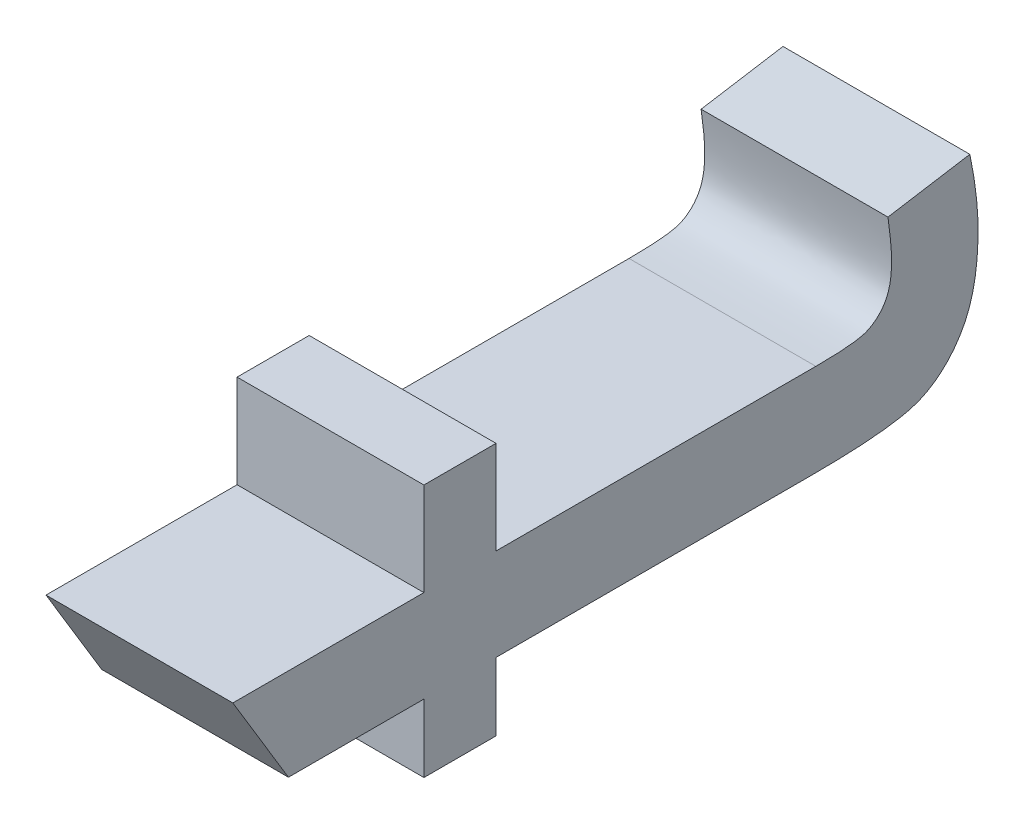
ISO-10303-21;
HEADER;
FILE_DESCRIPTION(('STEP AP214'),'2;1');
FILE_NAME('part.step','',(''),(''),'','','');
FILE_SCHEMA(('AUTOMOTIVE_DESIGN { 1 0 10303 214 1 1 1 1 }'));
ENDSEC;
DATA;
#1=APPLICATION_CONTEXT('core data for automotive mechanical design processes');
#2=APPLICATION_PROTOCOL_DEFINITION('international standard','automotive_design',2000,#1);
#3=PRODUCT_CONTEXT('',#1,'mechanical');
#4=PRODUCT('Part','Part','',(#3));
#5=PRODUCT_RELATED_PRODUCT_CATEGORY('part','',(#4));
#6=PRODUCT_DEFINITION_FORMATION('','',#4);
#7=PRODUCT_DEFINITION_CONTEXT('part definition',#1,'design');
#8=PRODUCT_DEFINITION('design','',#6,#7);
#9=PRODUCT_DEFINITION_SHAPE('','',#8);
#10=(LENGTH_UNIT() NAMED_UNIT(*) SI_UNIT(.MILLI.,.METRE.));
#11=(NAMED_UNIT(*) PLANE_ANGLE_UNIT() SI_UNIT($,.RADIAN.));
#12=(NAMED_UNIT(*) SI_UNIT($,.STERADIAN.) SOLID_ANGLE_UNIT());
#13=UNCERTAINTY_MEASURE_WITH_UNIT(LENGTH_MEASURE(1.E-05),#10,'distance_accuracy_value','');
#14=(GEOMETRIC_REPRESENTATION_CONTEXT(3) GLOBAL_UNCERTAINTY_ASSIGNED_CONTEXT((#13)) GLOBAL_UNIT_ASSIGNED_CONTEXT((#10,
#11,#12)) REPRESENTATION_CONTEXT('',''));
#15=CARTESIAN_POINT('',(0.,0.,0.));
#16=DIRECTION('',(0.,0.,1.));
#17=DIRECTION('',(1.,0.,0.));
#18=AXIS2_PLACEMENT_3D('',#15,#16,#17);
#19=CARTESIAN_POINT('',(4.55229940712926,-40.2591597344816,-8.76729471927809));
#20=DIRECTION('',(-1.,0.,0.));
#21=DIRECTION('',(0.,0.,1.));
#22=AXIS2_PLACEMENT_3D('',#19,#20,#21);
#23=PLANE('',#22);
#24=CARTESIAN_POINT('',(4.55229940712925,-40.2049248971093,-8.84692414060429));
#25=CARTESIAN_POINT('',(4.55229940712925,-40.180253903743,-8.83203884851736));
#26=CARTESIAN_POINT('',(4.55229940712925,-40.1555829103767,-8.81715355643041));
#27=(BOUNDED_CURVE() B_SPLINE_CURVE(2,(#24,#25,#26),.UNSPECIFIED.,.F.,
.F.) B_SPLINE_CURVE_WITH_KNOTS((3,3),(30.,31.),
.UNSPECIFIED.) CURVE() GEOMETRIC_REPRESENTATION_ITEM() RATIONAL_B_SPLINE_CURVE((1.,1.,1.)) REPRESENTATION_ITEM(''));
#28=CARTESIAN_POINT('',(4.55229940712925,-40.2049248971093,-8.84692414060429));
#29=VERTEX_POINT('',#28);
#30=CARTESIAN_POINT('',(4.55229940712925,-40.1555829103767,-8.81715355643041));
#31=VERTEX_POINT('',#30);
#32=EDGE_CURVE('E198',#29,#31,#27,.T.);
#33=ORIENTED_EDGE('',*,*,#32,.T.);
#34=CARTESIAN_POINT('',(4.55229940712925,-40.1555829103767,-8.81715355643041));
#35=CARTESIAN_POINT('',(4.55229940712925,-40.1555829103767,-8.86828729128463));
#36=CARTESIAN_POINT('',(4.55229940712925,-40.1555829103767,-8.91942102613884));
#37=(BOUNDED_CURVE() B_SPLINE_CURVE(2,(#34,#35,#36),.UNSPECIFIED.,.F.,
.F.) B_SPLINE_CURVE_WITH_KNOTS((3,3),(31.,32.),
.UNSPECIFIED.) CURVE() GEOMETRIC_REPRESENTATION_ITEM() RATIONAL_B_SPLINE_CURVE((1.,1.,1.)) REPRESENTATION_ITEM(''));
#38=CARTESIAN_POINT('',(4.55229940712925,-40.1555829103767,-8.91942102613884));
#39=VERTEX_POINT('',#38);
#40=EDGE_CURVE('E328',#31,#39,#37,.T.);
#41=ORIENTED_EDGE('',*,*,#40,.T.);
#42=CARTESIAN_POINT('',(4.55229940712925,-40.1555829103767,-8.91942102613884));
#43=CARTESIAN_POINT('',(4.55229940712924,-40.1306362634532,-8.91942102613884));
#44=CARTESIAN_POINT('',(4.55229940712924,-40.1056896165297,-8.91942102613884));
#45=(BOUNDED_CURVE() B_SPLINE_CURVE(2,(#42,#43,#44),.UNSPECIFIED.,.F.,
.F.) B_SPLINE_CURVE_WITH_KNOTS((3,3),(32.,33.),
.UNSPECIFIED.) CURVE() GEOMETRIC_REPRESENTATION_ITEM() RATIONAL_B_SPLINE_CURVE((1.,1.,1.)) REPRESENTATION_ITEM(''));
#46=CARTESIAN_POINT('',(4.55229940712924,-40.1056896165297,-8.91942102613884));
#47=VERTEX_POINT('',#46);
#48=EDGE_CURVE('E269',#39,#47,#45,.T.);
#49=ORIENTED_EDGE('',*,*,#48,.T.);
#50=CARTESIAN_POINT('',(4.55229940712924,-40.1056896165297,-8.91942102613884));
#51=CARTESIAN_POINT('',(4.55229940712924,-40.1056896165297,-8.93871677514042));
#52=CARTESIAN_POINT('',(4.55229940712924,-40.1056896165297,-8.95801252414201));
#53=(BOUNDED_CURVE() B_SPLINE_CURVE(2,(#50,#51,#52),.UNSPECIFIED.,.F.,
.F.) B_SPLINE_CURVE_WITH_KNOTS((3,3),(33.,34.),
.UNSPECIFIED.) CURVE() GEOMETRIC_REPRESENTATION_ITEM() RATIONAL_B_SPLINE_CURVE((1.,1.,1.)) REPRESENTATION_ITEM(''));
#54=CARTESIAN_POINT('',(4.55229940712924,-40.1056896165297,-8.95801252414201));
#55=VERTEX_POINT('',#54);
#56=EDGE_CURVE('E367',#47,#55,#53,.T.);
#57=ORIENTED_EDGE('',*,*,#56,.T.);
#58=CARTESIAN_POINT('',(4.55229940712924,-40.1056896165297,-8.95801252414201));
#59=CARTESIAN_POINT('',(4.55229940712924,-40.1306362634532,-8.95801252414201));
#60=CARTESIAN_POINT('',(4.55229940712925,-40.1555829103767,-8.95801252414201));
#61=(BOUNDED_CURVE() B_SPLINE_CURVE(2,(#58,#59,#60),.UNSPECIFIED.,.F.,
.F.) B_SPLINE_CURVE_WITH_KNOTS((3,3),(34.,35.),
.UNSPECIFIED.) CURVE() GEOMETRIC_REPRESENTATION_ITEM() RATIONAL_B_SPLINE_CURVE((1.,1.,1.)) REPRESENTATION_ITEM(''));
#62=CARTESIAN_POINT('',(4.55229940712925,-40.1555829103767,-8.95801252414201));
#63=VERTEX_POINT('',#62);
#64=EDGE_CURVE('E279',#55,#63,#61,.T.);
#65=ORIENTED_EDGE('',*,*,#64,.T.);
#66=CARTESIAN_POINT('',(4.55229940712925,-40.1555829103767,-8.95801252414201));
#67=CARTESIAN_POINT('',(4.55229940712925,-40.1555829103767,-9.04360295364191));
#68=CARTESIAN_POINT('',(4.55229940712925,-40.1555829103767,-9.12919338314181));
#69=(BOUNDED_CURVE() B_SPLINE_CURVE(2,(#66,#67,#68),.UNSPECIFIED.,.F.,
.F.) B_SPLINE_CURVE_WITH_KNOTS((3,3),(35.,36.),
.UNSPECIFIED.) CURVE() GEOMETRIC_REPRESENTATION_ITEM() RATIONAL_B_SPLINE_CURVE((1.,1.,1.)) REPRESENTATION_ITEM(''));
#70=CARTESIAN_POINT('',(4.55229940712925,-40.1555829103767,-9.12919338314181));
#71=VERTEX_POINT('',#70);
#72=EDGE_CURVE('E357',#63,#71,#69,.T.);
#73=ORIENTED_EDGE('',*,*,#72,.T.);
#74=CARTESIAN_POINT('',(4.55229940712925,-40.1555829103767,-9.12919338314181));
#75=CARTESIAN_POINT('',(4.55229940712925,-40.1555829103767,-9.15041870704356));
#76=CARTESIAN_POINT('',(4.55229940712925,-40.1529642015836,-9.1564830853012));
#77=CARTESIAN_POINT('',(4.55229940712925,-40.1503454927906,-9.16254746355884));
#78=CARTESIAN_POINT('',(4.55229940712925,-40.1444189413115,-9.166130959802));
#79=CARTESIAN_POINT('',(4.55229940712925,-40.1384923898324,-9.16971445604514));
#80=CARTESIAN_POINT('',(4.55229940712925,-40.1274662475458,-9.16971445604514));
#81=CARTESIAN_POINT('',(4.55229940712925,-40.1191966408308,-9.16971445604514));
#82=CARTESIAN_POINT('',(4.55229940712924,-40.1056896165297,-9.16778488114498));
#83=(BOUNDED_CURVE() B_SPLINE_CURVE(2,(#74,#75,#76,#77,#78,#79,#80,#81,#82),.UNSPECIFIED.,.F.,
.F.) B_SPLINE_CURVE_WITH_KNOTS((3,2,2,2,3),(36.,37.,38.,39.,40.),
.UNSPECIFIED.) CURVE() GEOMETRIC_REPRESENTATION_ITEM() RATIONAL_B_SPLINE_CURVE((1.,1.,1.,1.,1.,
1.,1.,1.,1.)) REPRESENTATION_ITEM(''));
#84=CARTESIAN_POINT('',(4.55229940712924,-40.1056896165297,-9.16778488114498));
#85=VERTEX_POINT('',#84);
#86=EDGE_CURVE('E187',#71,#85,#83,.T.);
#87=ORIENTED_EDGE('',*,*,#86,.T.);
#88=CARTESIAN_POINT('',(4.55229940712924,-40.1056896165297,-9.16778488114498));
#89=CARTESIAN_POINT('',(4.55229940712924,-40.1021061202866,-9.18969933893964));
#90=CARTESIAN_POINT('',(4.55229940712924,-40.0985226240434,-9.21161379673431));
#91=(BOUNDED_CURVE() B_SPLINE_CURVE(2,(#88,#89,#90),.UNSPECIFIED.,.F.,
.F.) B_SPLINE_CURVE_WITH_KNOTS((3,3),(40.,41.),
.UNSPECIFIED.) CURVE() GEOMETRIC_REPRESENTATION_ITEM() RATIONAL_B_SPLINE_CURVE((1.,1.,1.)) REPRESENTATION_ITEM(''));
#92=CARTESIAN_POINT('',(4.55229940712924,-40.0985226240434,-9.21161379673431));
#93=VERTEX_POINT('',#92);
#94=EDGE_CURVE('E257',#85,#93,#91,.T.);
#95=ORIENTED_EDGE('',*,*,#94,.T.);
#96=CARTESIAN_POINT('',(4.55229940712924,-40.0985226240434,-9.21161379673431));
#97=CARTESIAN_POINT('',(4.55229940712925,-40.119472294388,-9.21602425364896));
#98=CARTESIAN_POINT('',(4.55229940712925,-40.1360115078179,-9.21602425364896));
#99=CARTESIAN_POINT('',(4.55229940712925,-40.1630255564201,-9.21602425364896));
#100=CARTESIAN_POINT('',(4.55229940712925,-40.1779108485071,-9.20747899337683));
#101=CARTESIAN_POINT('',(4.55229940712926,-40.192796140594,-9.19893373310469));
#102=CARTESIAN_POINT('',(4.55229940712926,-40.1988605188517,-9.18501322846783));
#103=CARTESIAN_POINT('',(4.55229940712926,-40.2049248971093,-9.17109272383097));
#104=CARTESIAN_POINT('',(4.55229940712926,-40.2049248971093,-9.12643684757015));
#105=(BOUNDED_CURVE() B_SPLINE_CURVE(2,(#96,#97,#98,#99,#100,#101,#102,#103,#104),.UNSPECIFIED.,
.F.,.F.) B_SPLINE_CURVE_WITH_KNOTS((3,2,2,2,3),(41.,42.,43.,44.,45.),
.UNSPECIFIED.) CURVE() GEOMETRIC_REPRESENTATION_ITEM() RATIONAL_B_SPLINE_CURVE((1.,1.,1.,1.,1.,
1.,1.,1.,1.)) REPRESENTATION_ITEM(''));
#106=CARTESIAN_POINT('',(4.55229940712926,-40.2049248971093,-9.12643684757015));
#107=VERTEX_POINT('',#106);
#108=EDGE_CURVE('E168',#93,#107,#105,.T.);
#109=ORIENTED_EDGE('',*,*,#108,.T.);
#110=CARTESIAN_POINT('',(4.55229940712926,-40.2049248971093,-9.12643684757015));
#111=CARTESIAN_POINT('',(4.55229940712926,-40.2049248971093,-9.04222468585608));
#112=CARTESIAN_POINT('',(4.55229940712926,-40.2049248971093,-8.95801252414201));
#113=(BOUNDED_CURVE() B_SPLINE_CURVE(2,(#110,#111,#112),.UNSPECIFIED.,.F.,
.F.) B_SPLINE_CURVE_WITH_KNOTS((3,3),(45.,46.),
.UNSPECIFIED.) CURVE() GEOMETRIC_REPRESENTATION_ITEM() RATIONAL_B_SPLINE_CURVE((1.,1.,1.)) REPRESENTATION_ITEM(''));
#114=CARTESIAN_POINT('',(4.55229940712926,-40.2049248971093,-8.95801252414201));
#115=VERTEX_POINT('',#114);
#116=EDGE_CURVE('E165',#107,#115,#113,.T.);
#117=ORIENTED_EDGE('',*,*,#116,.T.);
#118=CARTESIAN_POINT('',(4.55229940712926,-40.2049248971093,-8.95801252414201));
#119=CARTESIAN_POINT('',(4.55229940712926,-40.2231180318822,-8.95801252414201));
#120=CARTESIAN_POINT('',(4.55229940712926,-40.2413111666552,-8.95801252414201));
#121=(BOUNDED_CURVE() B_SPLINE_CURVE(2,(#118,#119,#120),.UNSPECIFIED.,.F.,
.F.) B_SPLINE_CURVE_WITH_KNOTS((3,3),(46.,47.),
.UNSPECIFIED.) CURVE() GEOMETRIC_REPRESENTATION_ITEM() RATIONAL_B_SPLINE_CURVE((1.,1.,1.)) REPRESENTATION_ITEM(''));
#122=CARTESIAN_POINT('',(4.55229940712926,-40.2413111666552,-8.95801252414201));
#123=VERTEX_POINT('',#122);
#124=EDGE_CURVE('E152',#115,#123,#121,.T.);
#125=ORIENTED_EDGE('',*,*,#124,.T.);
#126=CARTESIAN_POINT('',(4.55229940712926,-40.2413111666552,-8.95801252414201));
#127=CARTESIAN_POINT('',(4.55229940712926,-40.2413111666552,-8.93871677514042));
#128=CARTESIAN_POINT('',(4.55229940712926,-40.2413111666552,-8.91942102613884));
#129=(BOUNDED_CURVE() B_SPLINE_CURVE(2,(#126,#127,#128),.UNSPECIFIED.,.F.,
.F.) B_SPLINE_CURVE_WITH_KNOTS((3,3),(47.,48.),
.UNSPECIFIED.) CURVE() GEOMETRIC_REPRESENTATION_ITEM() RATIONAL_B_SPLINE_CURVE((1.,1.,1.)) REPRESENTATION_ITEM(''));
#130=CARTESIAN_POINT('',(4.55229940712926,-40.2413111666552,-8.91942102613884));
#131=VERTEX_POINT('',#130);
#132=EDGE_CURVE('E423',#123,#131,#129,.T.);
#133=ORIENTED_EDGE('',*,*,#132,.T.);
#134=CARTESIAN_POINT('',(4.55229940712926,-40.2413111666552,-8.91942102613884));
#135=CARTESIAN_POINT('',(4.55229940712926,-40.2231180318822,-8.91942102613884));
#136=CARTESIAN_POINT('',(4.55229940712926,-40.2049248971093,-8.91942102613884));
#137=(BOUNDED_CURVE() B_SPLINE_CURVE(2,(#134,#135,#136),.UNSPECIFIED.,.F.,
.F.) B_SPLINE_CURVE_WITH_KNOTS((3,3),(48.,49.),
.UNSPECIFIED.) CURVE() GEOMETRIC_REPRESENTATION_ITEM() RATIONAL_B_SPLINE_CURVE((1.,1.,1.)) REPRESENTATION_ITEM(''));
#138=CARTESIAN_POINT('',(4.55229940712926,-40.2049248971093,-8.91942102613884));
#139=VERTEX_POINT('',#138);
#140=EDGE_CURVE('E224',#131,#139,#137,.T.);
#141=ORIENTED_EDGE('',*,*,#140,.T.);
#142=CARTESIAN_POINT('',(4.55229940712926,-40.2049248971093,-8.91942102613884));
#143=CARTESIAN_POINT('',(4.55229940712925,-40.2049248971093,-8.88317258337157));
#144=CARTESIAN_POINT('',(4.55229940712925,-40.2049248971093,-8.84692414060429));
#145=(BOUNDED_CURVE() B_SPLINE_CURVE(2,(#142,#143,#144),.UNSPECIFIED.,.F.,
.F.) B_SPLINE_CURVE_WITH_KNOTS((3,3),(49.,50.),
.UNSPECIFIED.) CURVE() GEOMETRIC_REPRESENTATION_ITEM() RATIONAL_B_SPLINE_CURVE((1.,1.,1.)) REPRESENTATION_ITEM(''));
#146=EDGE_CURVE('E11',#139,#29,#145,.T.);
#147=ORIENTED_EDGE('',*,*,#146,.T.);
#148=EDGE_LOOP('',(#33,#41,#49,#57,#65,#73,#87,#95,#109,#117,#125,#133,#141,#147));
#149=FACE_BOUND('',#148,.T.);
#150=ADVANCED_FACE('F16',(#149),#23,.T.);
#151=CARTESIAN_POINT('',(4.65229940712926,-40.2591597344816,-8.76729471927809));
#152=DIRECTION('',(1.,0.,0.));
#153=DIRECTION('',(0.,1.,0.));
#154=AXIS2_PLACEMENT_3D('',#151,#152,#153);
#155=PLANE('',#154);
#156=CARTESIAN_POINT('',(4.65229940712926,-40.2049248971093,-8.91942102613884));
#157=CARTESIAN_POINT('',(4.65229940712926,-40.2049248971093,-8.88317258337157));
#158=CARTESIAN_POINT('',(4.65229940712926,-40.2049248971093,-8.84692414060429));
#159=(BOUNDED_CURVE() B_SPLINE_CURVE(2,(#156,#157,#158),.UNSPECIFIED.,.F.,
.F.) B_SPLINE_CURVE_WITH_KNOTS((3,3),(49.,50.),
.UNSPECIFIED.) CURVE() GEOMETRIC_REPRESENTATION_ITEM() RATIONAL_B_SPLINE_CURVE((1.,1.,1.)) REPRESENTATION_ITEM(''));
#160=CARTESIAN_POINT('',(4.65229940712926,-40.2049248971093,-8.91942102613884));
#161=VERTEX_POINT('',#160);
#162=CARTESIAN_POINT('',(4.65229940712926,-40.2049248971093,-8.84692414060429));
#163=VERTEX_POINT('',#162);
#164=EDGE_CURVE('E31',#161,#163,#159,.T.);
#165=ORIENTED_EDGE('',*,*,#164,.F.);
#166=CARTESIAN_POINT('',(4.65229940712926,-40.2413111666552,-8.91942102613884));
#167=CARTESIAN_POINT('',(4.65229940712926,-40.2231180318822,-8.91942102613884));
#168=CARTESIAN_POINT('',(4.65229940712926,-40.2049248971093,-8.91942102613884));
#169=(BOUNDED_CURVE() B_SPLINE_CURVE(2,(#166,#167,#168),.UNSPECIFIED.,.F.,
.F.) B_SPLINE_CURVE_WITH_KNOTS((3,3),(48.,49.),
.UNSPECIFIED.) CURVE() GEOMETRIC_REPRESENTATION_ITEM() RATIONAL_B_SPLINE_CURVE((1.,1.,1.)) REPRESENTATION_ITEM(''));
#170=CARTESIAN_POINT('',(4.65229940712926,-40.2413111666552,-8.91942102613884));
#171=VERTEX_POINT('',#170);
#172=EDGE_CURVE('E225',#171,#161,#169,.T.);
#173=ORIENTED_EDGE('',*,*,#172,.F.);
#174=CARTESIAN_POINT('',(4.65229940712926,-40.2413111666552,-8.95801252414201));
#175=CARTESIAN_POINT('',(4.65229940712926,-40.2413111666552,-8.93871677514042));
#176=CARTESIAN_POINT('',(4.65229940712926,-40.2413111666552,-8.91942102613884));
#177=(BOUNDED_CURVE() B_SPLINE_CURVE(2,(#174,#175,#176),.UNSPECIFIED.,.F.,
.F.) B_SPLINE_CURVE_WITH_KNOTS((3,3),(47.,48.),
.UNSPECIFIED.) CURVE() GEOMETRIC_REPRESENTATION_ITEM() RATIONAL_B_SPLINE_CURVE((1.,1.,1.)) REPRESENTATION_ITEM(''));
#178=CARTESIAN_POINT('',(4.65229940712926,-40.2413111666552,-8.95801252414201));
#179=VERTEX_POINT('',#178);
#180=EDGE_CURVE('E162',#179,#171,#177,.T.);
#181=ORIENTED_EDGE('',*,*,#180,.F.);
#182=CARTESIAN_POINT('',(4.65229940712926,-40.2049248971093,-8.95801252414201));
#183=CARTESIAN_POINT('',(4.65229940712926,-40.2231180318822,-8.95801252414201));
#184=CARTESIAN_POINT('',(4.65229940712926,-40.2413111666552,-8.95801252414201));
#185=(BOUNDED_CURVE() B_SPLINE_CURVE(2,(#182,#183,#184),.UNSPECIFIED.,.F.,
.F.) B_SPLINE_CURVE_WITH_KNOTS((3,3),(46.,47.),
.UNSPECIFIED.) CURVE() GEOMETRIC_REPRESENTATION_ITEM() RATIONAL_B_SPLINE_CURVE((1.,1.,1.)) REPRESENTATION_ITEM(''));
#186=CARTESIAN_POINT('',(4.65229940712926,-40.2049248971093,-8.95801252414201));
#187=VERTEX_POINT('',#186);
#188=EDGE_CURVE('E22',#187,#179,#185,.T.);
#189=ORIENTED_EDGE('',*,*,#188,.F.);
#190=CARTESIAN_POINT('',(4.65229940712926,-40.2049248971093,-9.12643684757015));
#191=CARTESIAN_POINT('',(4.65229940712926,-40.2049248971093,-9.04222468585608));
#192=CARTESIAN_POINT('',(4.65229940712926,-40.2049248971093,-8.95801252414201));
#193=(BOUNDED_CURVE() B_SPLINE_CURVE(2,(#190,#191,#192),.UNSPECIFIED.,.F.,
.F.) B_SPLINE_CURVE_WITH_KNOTS((3,3),(45.,46.),
.UNSPECIFIED.) CURVE() GEOMETRIC_REPRESENTATION_ITEM() RATIONAL_B_SPLINE_CURVE((1.,1.,1.)) REPRESENTATION_ITEM(''));
#194=CARTESIAN_POINT('',(4.65229940712926,-40.2049248971093,-9.12643684757015));
#195=VERTEX_POINT('',#194);
#196=EDGE_CURVE('E175',#195,#187,#193,.T.);
#197=ORIENTED_EDGE('',*,*,#196,.F.);
#198=CARTESIAN_POINT('',(4.65229940712925,-40.0985226240434,-9.21161379673431));
#199=CARTESIAN_POINT('',(4.65229940712925,-40.119472294388,-9.21602425364896));
#200=CARTESIAN_POINT('',(4.65229940712925,-40.1360115078179,-9.21602425364896));
#201=CARTESIAN_POINT('',(4.65229940712925,-40.1630255564201,-9.21602425364896));
#202=CARTESIAN_POINT('',(4.65229940712926,-40.1779108485071,-9.20747899337683));
#203=CARTESIAN_POINT('',(4.65229940712926,-40.192796140594,-9.19893373310469));
#204=CARTESIAN_POINT('',(4.65229940712926,-40.1988605188516,-9.18501322846783));
#205=CARTESIAN_POINT('',(4.65229940712926,-40.2049248971093,-9.17109272383097));
#206=CARTESIAN_POINT('',(4.65229940712926,-40.2049248971093,-9.12643684757015));
#207=(BOUNDED_CURVE() B_SPLINE_CURVE(2,(#198,#199,#200,#201,#202,#203,#204,#205,#206),
.UNSPECIFIED.,.F.,.F.) B_SPLINE_CURVE_WITH_KNOTS((3,2,2,2,3),(41.,42.,43.,44.,45.),
.UNSPECIFIED.) CURVE() GEOMETRIC_REPRESENTATION_ITEM() RATIONAL_B_SPLINE_CURVE((1.,1.,1.,1.,1.,
1.,1.,1.,1.)) REPRESENTATION_ITEM(''));
#208=CARTESIAN_POINT('',(4.65229940712925,-40.0985226240434,-9.21161379673431));
#209=VERTEX_POINT('',#208);
#210=EDGE_CURVE('E288',#209,#195,#207,.T.);
#211=ORIENTED_EDGE('',*,*,#210,.F.);
#212=CARTESIAN_POINT('',(4.65229940712925,-40.1056896165297,-9.16778488114498));
#213=CARTESIAN_POINT('',(4.65229940712925,-40.1021061202866,-9.18969933893964));
#214=CARTESIAN_POINT('',(4.65229940712925,-40.0985226240434,-9.21161379673431));
#215=(BOUNDED_CURVE() B_SPLINE_CURVE(2,(#212,#213,#214),.UNSPECIFIED.,.F.,
.F.) B_SPLINE_CURVE_WITH_KNOTS((3,3),(40.,41.),
.UNSPECIFIED.) CURVE() GEOMETRIC_REPRESENTATION_ITEM() RATIONAL_B_SPLINE_CURVE((1.,1.,1.)) REPRESENTATION_ITEM(''));
#216=CARTESIAN_POINT('',(4.65229940712925,-40.1056896165297,-9.16778488114498));
#217=VERTEX_POINT('',#216);
#218=EDGE_CURVE('E258',#217,#209,#215,.T.);
#219=ORIENTED_EDGE('',*,*,#218,.F.);
#220=CARTESIAN_POINT('',(4.65229940712925,-40.1555829103767,-9.12919338314181));
#221=CARTESIAN_POINT('',(4.65229940712925,-40.1555829103767,-9.15041870704356));
#222=CARTESIAN_POINT('',(4.65229940712925,-40.1529642015836,-9.1564830853012));
#223=CARTESIAN_POINT('',(4.65229940712925,-40.1503454927905,-9.16254746355885));
#224=CARTESIAN_POINT('',(4.65229940712925,-40.1444189413115,-9.166130959802));
#225=CARTESIAN_POINT('',(4.65229940712925,-40.1384923898324,-9.16971445604514));
#226=CARTESIAN_POINT('',(4.65229940712925,-40.1274662475458,-9.16971445604515));
#227=CARTESIAN_POINT('',(4.65229940712925,-40.1191966408308,-9.16971445604515));
#228=CARTESIAN_POINT('',(4.65229940712925,-40.1056896165297,-9.16778488114498));
#229=(BOUNDED_CURVE() B_SPLINE_CURVE(2,(#220,#221,#222,#223,#224,#225,#226,#227,#228),
.UNSPECIFIED.,.F.,.F.) B_SPLINE_CURVE_WITH_KNOTS((3,2,2,2,3),(36.,37.,38.,39.,40.),
.UNSPECIFIED.) CURVE() GEOMETRIC_REPRESENTATION_ITEM() RATIONAL_B_SPLINE_CURVE((1.,1.,1.,1.,1.,
1.,1.,1.,1.)) REPRESENTATION_ITEM(''));
#230=CARTESIAN_POINT('',(4.65229940712925,-40.1555829103767,-9.12919338314181));
#231=VERTEX_POINT('',#230);
#232=EDGE_CURVE('E347',#231,#217,#229,.T.);
#233=ORIENTED_EDGE('',*,*,#232,.F.);
#234=CARTESIAN_POINT('',(4.65229940712925,-40.1555829103767,-8.95801252414201));
#235=CARTESIAN_POINT('',(4.65229940712925,-40.1555829103767,-9.04360295364191));
#236=CARTESIAN_POINT('',(4.65229940712925,-40.1555829103767,-9.12919338314181));
#237=(BOUNDED_CURVE() B_SPLINE_CURVE(2,(#234,#235,#236),.UNSPECIFIED.,.F.,
.F.) B_SPLINE_CURVE_WITH_KNOTS((3,3),(35.,36.),
.UNSPECIFIED.) CURVE() GEOMETRIC_REPRESENTATION_ITEM() RATIONAL_B_SPLINE_CURVE((1.,1.,1.)) REPRESENTATION_ITEM(''));
#238=CARTESIAN_POINT('',(4.65229940712925,-40.1555829103767,-8.95801252414201));
#239=VERTEX_POINT('',#238);
#240=EDGE_CURVE('E358',#239,#231,#237,.T.);
#241=ORIENTED_EDGE('',*,*,#240,.F.);
#242=CARTESIAN_POINT('',(4.65229940712924,-40.1056896165297,-8.95801252414201));
#243=CARTESIAN_POINT('',(4.65229940712925,-40.1306362634532,-8.95801252414201));
#244=CARTESIAN_POINT('',(4.65229940712925,-40.1555829103767,-8.95801252414201));
#245=(BOUNDED_CURVE() B_SPLINE_CURVE(2,(#242,#243,#244),.UNSPECIFIED.,.F.,
.F.) B_SPLINE_CURVE_WITH_KNOTS((3,3),(34.,35.),
.UNSPECIFIED.) CURVE() GEOMETRIC_REPRESENTATION_ITEM() RATIONAL_B_SPLINE_CURVE((1.,1.,1.)) REPRESENTATION_ITEM(''));
#246=CARTESIAN_POINT('',(4.65229940712924,-40.1056896165297,-8.95801252414201));
#247=VERTEX_POINT('',#246);
#248=EDGE_CURVE('E280',#247,#239,#245,.T.);
#249=ORIENTED_EDGE('',*,*,#248,.F.);
#250=CARTESIAN_POINT('',(4.65229940712924,-40.1056896165297,-8.91942102613884));
#251=CARTESIAN_POINT('',(4.65229940712924,-40.1056896165297,-8.93871677514042));
#252=CARTESIAN_POINT('',(4.65229940712924,-40.1056896165297,-8.95801252414201));
#253=(BOUNDED_CURVE() B_SPLINE_CURVE(2,(#250,#251,#252),.UNSPECIFIED.,.F.,
.F.) B_SPLINE_CURVE_WITH_KNOTS((3,3),(33.,34.),
.UNSPECIFIED.) CURVE() GEOMETRIC_REPRESENTATION_ITEM() RATIONAL_B_SPLINE_CURVE((1.,1.,1.)) REPRESENTATION_ITEM(''));
#254=CARTESIAN_POINT('',(4.65229940712924,-40.1056896165297,-8.91942102613884));
#255=VERTEX_POINT('',#254);
#256=EDGE_CURVE('E259',#255,#247,#253,.T.);
#257=ORIENTED_EDGE('',*,*,#256,.F.);
#258=CARTESIAN_POINT('',(4.65229940712925,-40.1555829103767,-8.91942102613884));
#259=CARTESIAN_POINT('',(4.65229940712925,-40.1306362634532,-8.91942102613884));
#260=CARTESIAN_POINT('',(4.65229940712924,-40.1056896165297,-8.91942102613884));
#261=(BOUNDED_CURVE() B_SPLINE_CURVE(2,(#258,#259,#260),.UNSPECIFIED.,.F.,
.F.) B_SPLINE_CURVE_WITH_KNOTS((3,3),(32.,33.),
.UNSPECIFIED.) CURVE() GEOMETRIC_REPRESENTATION_ITEM() RATIONAL_B_SPLINE_CURVE((1.,1.,1.)) REPRESENTATION_ITEM(''));
#262=CARTESIAN_POINT('',(4.65229940712925,-40.1555829103767,-8.91942102613884));
#263=VERTEX_POINT('',#262);
#264=EDGE_CURVE('E319',#263,#255,#261,.T.);
#265=ORIENTED_EDGE('',*,*,#264,.F.);
#266=CARTESIAN_POINT('',(4.65229940712925,-40.1555829103767,-8.81715355643042));
#267=CARTESIAN_POINT('',(4.65229940712925,-40.1555829103767,-8.86828729128463));
#268=CARTESIAN_POINT('',(4.65229940712925,-40.1555829103767,-8.91942102613884));
#269=(BOUNDED_CURVE() B_SPLINE_CURVE(2,(#266,#267,#268),.UNSPECIFIED.,.F.,
.F.) B_SPLINE_CURVE_WITH_KNOTS((3,3),(31.,32.),
.UNSPECIFIED.) CURVE() GEOMETRIC_REPRESENTATION_ITEM() RATIONAL_B_SPLINE_CURVE((1.,1.,1.)) REPRESENTATION_ITEM(''));
#270=CARTESIAN_POINT('',(4.65229940712925,-40.1555829103767,-8.81715355643042));
#271=VERTEX_POINT('',#270);
#272=EDGE_CURVE('E197',#271,#263,#269,.T.);
#273=ORIENTED_EDGE('',*,*,#272,.F.);
#274=CARTESIAN_POINT('',(4.65229940712926,-40.2049248971093,-8.84692414060429));
#275=CARTESIAN_POINT('',(4.65229940712925,-40.180253903743,-8.83203884851736));
#276=CARTESIAN_POINT('',(4.65229940712925,-40.1555829103767,-8.81715355643042));
#277=(BOUNDED_CURVE() B_SPLINE_CURVE(2,(#274,#275,#276),.UNSPECIFIED.,.F.,
.F.) B_SPLINE_CURVE_WITH_KNOTS((3,3),(30.,31.),
.UNSPECIFIED.) CURVE() GEOMETRIC_REPRESENTATION_ITEM() RATIONAL_B_SPLINE_CURVE((1.,1.,1.)) REPRESENTATION_ITEM(''));
#278=EDGE_CURVE('E239',#163,#271,#277,.T.);
#279=ORIENTED_EDGE('',*,*,#278,.F.);
#280=EDGE_LOOP('',(#165,#173,#181,#189,#197,#211,#219,#233,#241,#249,#257,#265,#273,#279));
#281=FACE_BOUND('',#280,.T.);
#282=ADVANCED_FACE('F528',(#281),#155,.T.);
#283=CARTESIAN_POINT('',(4.65229940712926,-40.2049248971093,-8.91942102613884));
#284=CARTESIAN_POINT('',(4.55229940712926,-40.2049248971093,-8.91942102613884));
#285=CARTESIAN_POINT('',(4.65229940712926,-40.2049248971093,-8.88317258337157));
#286=CARTESIAN_POINT('',(4.55229940712925,-40.2049248971093,-8.88317258337157));
#287=CARTESIAN_POINT('',(4.65229940712926,-40.2049248971093,-8.84692414060429));
#288=CARTESIAN_POINT('',(4.55229940712925,-40.2049248971093,-8.84692414060429));
#289=(BOUNDED_SURFACE() B_SPLINE_SURFACE(2,1,((#283,#284),(#285,#286),(#287,#288)),
.UNSPECIFIED.,.F.,.F.,.F.) B_SPLINE_SURFACE_WITH_KNOTS((3,3),(2,2),(49.,50.),(0.,0.1),
.UNSPECIFIED.) GEOMETRIC_REPRESENTATION_ITEM() RATIONAL_B_SPLINE_SURFACE(((1.,1.),(1.,1.),(1.,1.))) REPRESENTATION_ITEM('') SURFACE());
#290=CARTESIAN_POINT('',(4.65229940712926,-40.2049248971093,-8.84692414060429));
#291=CARTESIAN_POINT('',(4.55229940712925,-40.2049248971093,-8.84692414060429));
#292=(BOUNDED_CURVE() B_SPLINE_CURVE(1,(#290,#291),.UNSPECIFIED.,.F.,
.F.) B_SPLINE_CURVE_WITH_KNOTS((2,2),(0.,0.1),
.UNSPECIFIED.) CURVE() GEOMETRIC_REPRESENTATION_ITEM() RATIONAL_B_SPLINE_CURVE((1.,1.)) REPRESENTATION_ITEM(''));
#293=EDGE_CURVE('E190',#163,#29,#292,.T.);
#294=CARTESIAN_POINT('',(4.65229940712926,-40.2049248971093,-8.91942102613884));
#295=CARTESIAN_POINT('',(4.55229940712926,-40.2049248971093,-8.91942102613884));
#296=(BOUNDED_CURVE() B_SPLINE_CURVE(1,(#294,#295),.UNSPECIFIED.,.F.,
.F.) B_SPLINE_CURVE_WITH_KNOTS((2,2),(0.,0.1),
.UNSPECIFIED.) CURVE() GEOMETRIC_REPRESENTATION_ITEM() RATIONAL_B_SPLINE_CURVE((1.,1.)) REPRESENTATION_ITEM(''));
#297=EDGE_CURVE('E216',#161,#139,#296,.T.);
#298=ORIENTED_EDGE('',*,*,#164,.T.);
#299=ORIENTED_EDGE('',*,*,#293,.T.);
#300=ORIENTED_EDGE('',*,*,#146,.F.);
#301=ORIENTED_EDGE('',*,*,#297,.F.);
#302=EDGE_LOOP('',(#298,#299,#300,#301));
#303=FACE_BOUND('',#302,.T.);
#304=ADVANCED_FACE('F558',(#303),#289,.T.);
#305=CARTESIAN_POINT('',(4.65229940712926,-40.2413111666552,-8.91942102613884));
#306=CARTESIAN_POINT('',(4.55229940712926,-40.2413111666552,-8.91942102613884));
#307=CARTESIAN_POINT('',(4.65229940712926,-40.2231180318822,-8.91942102613884));
#308=CARTESIAN_POINT('',(4.55229940712926,-40.2231180318822,-8.91942102613884));
#309=CARTESIAN_POINT('',(4.65229940712926,-40.2049248971093,-8.91942102613884));
#310=CARTESIAN_POINT('',(4.55229940712926,-40.2049248971093,-8.91942102613884));
#311=(BOUNDED_SURFACE() B_SPLINE_SURFACE(2,1,((#305,#306),(#307,#308),(#309,#310)),
.UNSPECIFIED.,.F.,.F.,.F.) B_SPLINE_SURFACE_WITH_KNOTS((3,3),(2,2),(48.,49.),(0.,0.1),
.UNSPECIFIED.) GEOMETRIC_REPRESENTATION_ITEM() RATIONAL_B_SPLINE_SURFACE(((1.,1.),(1.,1.),(1.,1.))) REPRESENTATION_ITEM('') SURFACE());
#312=CARTESIAN_POINT('',(4.65229940712926,-40.2413111666552,-8.91942102613884));
#313=CARTESIAN_POINT('',(4.55229940712926,-40.2413111666552,-8.91942102613884));
#314=(BOUNDED_CURVE() B_SPLINE_CURVE(1,(#312,#313),.UNSPECIFIED.,.F.,
.F.) B_SPLINE_CURVE_WITH_KNOTS((2,2),(0.,0.1),
.UNSPECIFIED.) CURVE() GEOMETRIC_REPRESENTATION_ITEM() RATIONAL_B_SPLINE_CURVE((1.,1.)) REPRESENTATION_ITEM(''));
#315=EDGE_CURVE('E207',#171,#131,#314,.T.);
#316=ORIENTED_EDGE('',*,*,#172,.T.);
#317=ORIENTED_EDGE('',*,*,#297,.T.);
#318=ORIENTED_EDGE('',*,*,#140,.F.);
#319=ORIENTED_EDGE('',*,*,#315,.F.);
#320=EDGE_LOOP('',(#316,#317,#318,#319));
#321=FACE_BOUND('',#320,.T.);
#322=ADVANCED_FACE('F598',(#321),#311,.T.);
#323=CARTESIAN_POINT('',(4.65229940712926,-40.2413111666552,-8.95801252414201));
#324=CARTESIAN_POINT('',(4.55229940712926,-40.2413111666552,-8.95801252414201));
#325=CARTESIAN_POINT('',(4.65229940712926,-40.2413111666552,-8.93871677514042));
#326=CARTESIAN_POINT('',(4.55229940712926,-40.2413111666552,-8.93871677514042));
#327=CARTESIAN_POINT('',(4.65229940712926,-40.2413111666552,-8.91942102613884));
#328=CARTESIAN_POINT('',(4.55229940712926,-40.2413111666552,-8.91942102613884));
#329=(BOUNDED_SURFACE() B_SPLINE_SURFACE(2,1,((#323,#324),(#325,#326),(#327,#328)),
.UNSPECIFIED.,.F.,.F.,.F.) B_SPLINE_SURFACE_WITH_KNOTS((3,3),(2,2),(47.,48.),(0.,0.1),
.UNSPECIFIED.) GEOMETRIC_REPRESENTATION_ITEM() RATIONAL_B_SPLINE_SURFACE(((1.,1.),(1.,1.),(1.,1.))) REPRESENTATION_ITEM('') SURFACE());
#330=CARTESIAN_POINT('',(4.65229940712926,-40.2413111666552,-8.95801252414201));
#331=CARTESIAN_POINT('',(4.55229940712926,-40.2413111666552,-8.95801252414201));
#332=(BOUNDED_CURVE() B_SPLINE_CURVE(1,(#330,#331),.UNSPECIFIED.,.F.,
.F.) B_SPLINE_CURVE_WITH_KNOTS((2,2),(0.,0.1),
.UNSPECIFIED.) CURVE() GEOMETRIC_REPRESENTATION_ITEM() RATIONAL_B_SPLINE_CURVE((1.,1.)) REPRESENTATION_ITEM(''));
#333=EDGE_CURVE('E158',#179,#123,#332,.T.);
#334=ORIENTED_EDGE('',*,*,#180,.T.);
#335=ORIENTED_EDGE('',*,*,#315,.T.);
#336=ORIENTED_EDGE('',*,*,#132,.F.);
#337=ORIENTED_EDGE('',*,*,#333,.F.);
#338=EDGE_LOOP('',(#334,#335,#336,#337));
#339=FACE_BOUND('',#338,.T.);
#340=ADVANCED_FACE('F588',(#339),#329,.T.);
#341=CARTESIAN_POINT('',(4.65229940712926,-40.2049248971093,-8.95801252414201));
#342=CARTESIAN_POINT('',(4.55229940712926,-40.2049248971093,-8.95801252414201));
#343=CARTESIAN_POINT('',(4.65229940712926,-40.2231180318822,-8.95801252414201));
#344=CARTESIAN_POINT('',(4.55229940712926,-40.2231180318822,-8.95801252414201));
#345=CARTESIAN_POINT('',(4.65229940712926,-40.2413111666552,-8.95801252414201));
#346=CARTESIAN_POINT('',(4.55229940712926,-40.2413111666552,-8.95801252414201));
#347=(BOUNDED_SURFACE() B_SPLINE_SURFACE(2,1,((#341,#342),(#343,#344),(#345,#346)),
.UNSPECIFIED.,.F.,.F.,.F.) B_SPLINE_SURFACE_WITH_KNOTS((3,3),(2,2),(46.,47.),(0.,0.1),
.UNSPECIFIED.) GEOMETRIC_REPRESENTATION_ITEM() RATIONAL_B_SPLINE_SURFACE(((1.,1.),(1.,1.),(1.,1.))) REPRESENTATION_ITEM('') SURFACE());
#348=CARTESIAN_POINT('',(4.65229940712926,-40.2049248971093,-8.95801252414201));
#349=CARTESIAN_POINT('',(4.55229940712926,-40.2049248971093,-8.95801252414201));
#350=(BOUNDED_CURVE() B_SPLINE_CURVE(1,(#348,#349),.UNSPECIFIED.,.F.,
.F.) B_SPLINE_CURVE_WITH_KNOTS((2,2),(0.,0.1),
.UNSPECIFIED.) CURVE() GEOMETRIC_REPRESENTATION_ITEM() RATIONAL_B_SPLINE_CURVE((1.,1.)) REPRESENTATION_ITEM(''));
#351=EDGE_CURVE('E155',#187,#115,#350,.T.);
#352=ORIENTED_EDGE('',*,*,#188,.T.);
#353=ORIENTED_EDGE('',*,*,#333,.T.);
#354=ORIENTED_EDGE('',*,*,#124,.F.);
#355=ORIENTED_EDGE('',*,*,#351,.F.);
#356=EDGE_LOOP('',(#352,#353,#354,#355));
#357=FACE_BOUND('',#356,.T.);
#358=ADVANCED_FACE('F18',(#357),#347,.T.);
#359=CARTESIAN_POINT('',(4.65229940712926,-40.2049248971093,-9.12643684757015));
#360=CARTESIAN_POINT('',(4.55229940712926,-40.2049248971093,-9.12643684757015));
#361=CARTESIAN_POINT('',(4.65229940712926,-40.2049248971093,-9.04222468585608));
#362=CARTESIAN_POINT('',(4.55229940712926,-40.2049248971093,-9.04222468585608));
#363=CARTESIAN_POINT('',(4.65229940712926,-40.2049248971093,-8.95801252414201));
#364=CARTESIAN_POINT('',(4.55229940712926,-40.2049248971093,-8.95801252414201));
#365=(BOUNDED_SURFACE() B_SPLINE_SURFACE(2,1,((#359,#360),(#361,#362),(#363,#364)),
.UNSPECIFIED.,.F.,.F.,.F.) B_SPLINE_SURFACE_WITH_KNOTS((3,3),(2,2),(45.,46.),(0.,0.1),
.UNSPECIFIED.) GEOMETRIC_REPRESENTATION_ITEM() RATIONAL_B_SPLINE_SURFACE(((1.,1.),(1.,1.),(1.,1.))) REPRESENTATION_ITEM('') SURFACE());
#366=CARTESIAN_POINT('',(4.65229940712926,-40.2049248971093,-9.12643684757015));
#367=CARTESIAN_POINT('',(4.55229940712926,-40.2049248971093,-9.12643684757015));
#368=(BOUNDED_CURVE() B_SPLINE_CURVE(1,(#366,#367),.UNSPECIFIED.,.F.,
.F.) B_SPLINE_CURVE_WITH_KNOTS((2,2),(0.,0.1),
.UNSPECIFIED.) CURVE() GEOMETRIC_REPRESENTATION_ITEM() RATIONAL_B_SPLINE_CURVE((1.,1.)) REPRESENTATION_ITEM(''));
#369=EDGE_CURVE('E297',#195,#107,#368,.T.);
#370=ORIENTED_EDGE('',*,*,#196,.T.);
#371=ORIENTED_EDGE('',*,*,#351,.T.);
#372=ORIENTED_EDGE('',*,*,#116,.F.);
#373=ORIENTED_EDGE('',*,*,#369,.F.);
#374=EDGE_LOOP('',(#370,#371,#372,#373));
#375=FACE_BOUND('',#374,.T.);
#376=ADVANCED_FACE('F174',(#375),#365,.T.);
#377=CARTESIAN_POINT('',(4.65229940712925,-40.0985226240434,-9.21161379673431));
#378=CARTESIAN_POINT('',(4.55229940712924,-40.0985226240434,-9.21161379673431));
#379=CARTESIAN_POINT('',(4.65229940712925,-40.119472294388,-9.21602425364896));
#380=CARTESIAN_POINT('',(4.55229940712925,-40.119472294388,-9.21602425364896));
#381=CARTESIAN_POINT('',(4.65229940712925,-40.1360115078179,-9.21602425364896));
#382=CARTESIAN_POINT('',(4.55229940712925,-40.1360115078179,-9.21602425364896));
#383=CARTESIAN_POINT('',(4.65229940712925,-40.1630255564201,-9.21602425364896));
#384=CARTESIAN_POINT('',(4.55229940712925,-40.1630255564201,-9.21602425364896));
#385=CARTESIAN_POINT('',(4.65229940712926,-40.1779108485071,-9.20747899337683));
#386=CARTESIAN_POINT('',(4.55229940712925,-40.1779108485071,-9.20747899337683));
#387=CARTESIAN_POINT('',(4.65229940712926,-40.192796140594,-9.19893373310469));
#388=CARTESIAN_POINT('',(4.55229940712926,-40.192796140594,-9.19893373310469));
#389=CARTESIAN_POINT('',(4.65229940712926,-40.1988605188516,-9.18501322846783));
#390=CARTESIAN_POINT('',(4.55229940712926,-40.1988605188517,-9.18501322846783));
#391=CARTESIAN_POINT('',(4.65229940712926,-40.2049248971093,-9.17109272383097));
#392=CARTESIAN_POINT('',(4.55229940712926,-40.2049248971093,-9.17109272383097));
#393=CARTESIAN_POINT('',(4.65229940712926,-40.2049248971093,-9.12643684757015));
#394=CARTESIAN_POINT('',(4.55229940712926,-40.2049248971093,-9.12643684757015));
#395=(BOUNDED_SURFACE() B_SPLINE_SURFACE(2,1,((#377,#378),(#379,#380),(#381,#382),(#383,#384),
(#385,#386),(#387,#388),(#389,#390),(#391,#392),(#393,#394)),.UNSPECIFIED.,.F.,.F.,
.F.) B_SPLINE_SURFACE_WITH_KNOTS((3,2,2,2,3),(2,2),(41.,42.,43.,44.,45.),(0.,0.1),
.UNSPECIFIED.) GEOMETRIC_REPRESENTATION_ITEM() RATIONAL_B_SPLINE_SURFACE(((1.,1.),(1.,1.),(1.,
1.),(1.,1.),(1.,1.),(1.,1.),(1.,1.),(1.,1.),(1.,1.))) REPRESENTATION_ITEM('') SURFACE());
#396=CARTESIAN_POINT('',(4.65229940712925,-40.0985226240434,-9.21161379673431));
#397=CARTESIAN_POINT('',(4.55229940712924,-40.0985226240434,-9.21161379673431));
#398=(BOUNDED_CURVE() B_SPLINE_CURVE(1,(#396,#397),.UNSPECIFIED.,.F.,
.F.) B_SPLINE_CURVE_WITH_KNOTS((2,2),(0.,0.1),
.UNSPECIFIED.) CURVE() GEOMETRIC_REPRESENTATION_ITEM() RATIONAL_B_SPLINE_CURVE((1.,1.)) REPRESENTATION_ITEM(''));
#399=EDGE_CURVE('E248',#209,#93,#398,.T.);
#400=ORIENTED_EDGE('',*,*,#210,.T.);
#401=ORIENTED_EDGE('',*,*,#369,.T.);
#402=ORIENTED_EDGE('',*,*,#108,.F.);
#403=ORIENTED_EDGE('',*,*,#399,.F.);
#404=EDGE_LOOP('',(#400,#401,#402,#403));
#405=FACE_BOUND('',#404,.T.);
#406=ADVANCED_FACE('F540',(#405),#395,.T.);
#407=CARTESIAN_POINT('',(4.65229940712925,-40.1056896165297,-9.16778488114498));
#408=CARTESIAN_POINT('',(4.55229940712924,-40.1056896165297,-9.16778488114498));
#409=CARTESIAN_POINT('',(4.65229940712925,-40.1021061202866,-9.18969933893964));
#410=CARTESIAN_POINT('',(4.55229940712924,-40.1021061202866,-9.18969933893964));
#411=CARTESIAN_POINT('',(4.65229940712925,-40.0985226240434,-9.21161379673431));
#412=CARTESIAN_POINT('',(4.55229940712924,-40.0985226240434,-9.21161379673431));
#413=(BOUNDED_SURFACE() B_SPLINE_SURFACE(2,1,((#407,#408),(#409,#410),(#411,#412)),
.UNSPECIFIED.,.F.,.F.,.F.) B_SPLINE_SURFACE_WITH_KNOTS((3,3),(2,2),(40.,41.),(0.,0.1),
.UNSPECIFIED.) GEOMETRIC_REPRESENTATION_ITEM() RATIONAL_B_SPLINE_SURFACE(((1.,1.),(1.,1.),(1.,1.))) REPRESENTATION_ITEM('') SURFACE());
#414=CARTESIAN_POINT('',(4.65229940712925,-40.1056896165297,-9.16778488114498));
#415=CARTESIAN_POINT('',(4.55229940712924,-40.1056896165297,-9.16778488114498));
#416=(BOUNDED_CURVE() B_SPLINE_CURVE(1,(#414,#415),.UNSPECIFIED.,.F.,
.F.) B_SPLINE_CURVE_WITH_KNOTS((2,2),(0.,0.1),
.UNSPECIFIED.) CURVE() GEOMETRIC_REPRESENTATION_ITEM() RATIONAL_B_SPLINE_CURVE((1.,1.)) REPRESENTATION_ITEM(''));
#417=EDGE_CURVE('E338',#217,#85,#416,.T.);
#418=ORIENTED_EDGE('',*,*,#218,.T.);
#419=ORIENTED_EDGE('',*,*,#399,.T.);
#420=ORIENTED_EDGE('',*,*,#94,.F.);
#421=ORIENTED_EDGE('',*,*,#417,.F.);
#422=EDGE_LOOP('',(#418,#419,#420,#421));
#423=FACE_BOUND('',#422,.T.);
#424=ADVANCED_FACE('F537',(#423),#413,.T.);
#425=CARTESIAN_POINT('',(4.65229940712925,-40.1555829103767,-9.12919338314181));
#426=CARTESIAN_POINT('',(4.55229940712925,-40.1555829103767,-9.12919338314181));
#427=CARTESIAN_POINT('',(4.65229940712925,-40.1555829103767,-9.15041870704356));
#428=CARTESIAN_POINT('',(4.55229940712925,-40.1555829103767,-9.15041870704356));
#429=CARTESIAN_POINT('',(4.65229940712925,-40.1529642015836,-9.1564830853012));
#430=CARTESIAN_POINT('',(4.55229940712925,-40.1529642015836,-9.1564830853012));
#431=CARTESIAN_POINT('',(4.65229940712925,-40.1503454927905,-9.16254746355885));
#432=CARTESIAN_POINT('',(4.55229940712925,-40.1503454927906,-9.16254746355884));
#433=CARTESIAN_POINT('',(4.65229940712925,-40.1444189413115,-9.166130959802));
#434=CARTESIAN_POINT('',(4.55229940712925,-40.1444189413115,-9.166130959802));
#435=CARTESIAN_POINT('',(4.65229940712925,-40.1384923898324,-9.16971445604514));
#436=CARTESIAN_POINT('',(4.55229940712925,-40.1384923898324,-9.16971445604514));
#437=CARTESIAN_POINT('',(4.65229940712925,-40.1274662475458,-9.16971445604515));
#438=CARTESIAN_POINT('',(4.55229940712925,-40.1274662475458,-9.16971445604514));
#439=CARTESIAN_POINT('',(4.65229940712925,-40.1191966408308,-9.16971445604515));
#440=CARTESIAN_POINT('',(4.55229940712925,-40.1191966408308,-9.16971445604514));
#441=CARTESIAN_POINT('',(4.65229940712925,-40.1056896165297,-9.16778488114498));
#442=CARTESIAN_POINT('',(4.55229940712924,-40.1056896165297,-9.16778488114498));
#443=(BOUNDED_SURFACE() B_SPLINE_SURFACE(2,1,((#425,#426),(#427,#428),(#429,#430),(#431,#432),
(#433,#434),(#435,#436),(#437,#438),(#439,#440),(#441,#442)),.UNSPECIFIED.,.F.,.F.,
.F.) B_SPLINE_SURFACE_WITH_KNOTS((3,2,2,2,3),(2,2),(36.,37.,38.,39.,40.),(0.,0.1),
.UNSPECIFIED.) GEOMETRIC_REPRESENTATION_ITEM() RATIONAL_B_SPLINE_SURFACE(((1.,1.),(1.,1.),(1.,
1.),(1.,1.),(1.,1.),(1.,1.),(1.,1.),(1.,1.),(1.,1.))) REPRESENTATION_ITEM('') SURFACE());
#444=CARTESIAN_POINT('',(4.65229940712925,-40.1555829103767,-9.12919338314181));
#445=CARTESIAN_POINT('',(4.55229940712925,-40.1555829103767,-9.12919338314181));
#446=(BOUNDED_CURVE() B_SPLINE_CURVE(1,(#444,#445),.UNSPECIFIED.,.F.,
.F.) B_SPLINE_CURVE_WITH_KNOTS((2,2),(0.,0.1),
.UNSPECIFIED.) CURVE() GEOMETRIC_REPRESENTATION_ITEM() RATIONAL_B_SPLINE_CURVE((1.,1.)) REPRESENTATION_ITEM(''));
#447=EDGE_CURVE('E348',#231,#71,#446,.T.);
#448=ORIENTED_EDGE('',*,*,#232,.T.);
#449=ORIENTED_EDGE('',*,*,#417,.T.);
#450=ORIENTED_EDGE('',*,*,#86,.F.);
#451=ORIENTED_EDGE('',*,*,#447,.F.);
#452=EDGE_LOOP('',(#448,#449,#450,#451));
#453=FACE_BOUND('',#452,.T.);
#454=ADVANCED_FACE('F535',(#453),#443,.T.);
#455=CARTESIAN_POINT('',(4.65229940712925,-40.1555829103767,-8.95801252414201));
#456=CARTESIAN_POINT('',(4.55229940712925,-40.1555829103767,-8.95801252414201));
#457=CARTESIAN_POINT('',(4.65229940712925,-40.1555829103767,-9.04360295364191));
#458=CARTESIAN_POINT('',(4.55229940712925,-40.1555829103767,-9.04360295364191));
#459=CARTESIAN_POINT('',(4.65229940712925,-40.1555829103767,-9.12919338314181));
#460=CARTESIAN_POINT('',(4.55229940712925,-40.1555829103767,-9.12919338314181));
#461=(BOUNDED_SURFACE() B_SPLINE_SURFACE(2,1,((#455,#456),(#457,#458),(#459,#460)),
.UNSPECIFIED.,.F.,.F.,.F.) B_SPLINE_SURFACE_WITH_KNOTS((3,3),(2,2),(35.,36.),(0.,0.1),
.UNSPECIFIED.) GEOMETRIC_REPRESENTATION_ITEM() RATIONAL_B_SPLINE_SURFACE(((1.,1.),(1.,1.),(1.,1.))) REPRESENTATION_ITEM('') SURFACE());
#462=CARTESIAN_POINT('',(4.65229940712925,-40.1555829103767,-8.95801252414201));
#463=CARTESIAN_POINT('',(4.55229940712925,-40.1555829103767,-8.95801252414201));
#464=(BOUNDED_CURVE() B_SPLINE_CURVE(1,(#462,#463),.UNSPECIFIED.,.F.,
.F.) B_SPLINE_CURVE_WITH_KNOTS((2,2),(0.,0.1),
.UNSPECIFIED.) CURVE() GEOMETRIC_REPRESENTATION_ITEM() RATIONAL_B_SPLINE_CURVE((1.,1.)) REPRESENTATION_ITEM(''));
#465=EDGE_CURVE('E270',#239,#63,#464,.T.);
#466=ORIENTED_EDGE('',*,*,#240,.T.);
#467=ORIENTED_EDGE('',*,*,#447,.T.);
#468=ORIENTED_EDGE('',*,*,#72,.F.);
#469=ORIENTED_EDGE('',*,*,#465,.F.);
#470=EDGE_LOOP('',(#466,#467,#468,#469));
#471=FACE_BOUND('',#470,.T.);
#472=ADVANCED_FACE('F531',(#471),#461,.T.);
#473=CARTESIAN_POINT('',(4.65229940712924,-40.1056896165297,-8.95801252414201));
#474=CARTESIAN_POINT('',(4.55229940712924,-40.1056896165297,-8.95801252414201));
#475=CARTESIAN_POINT('',(4.65229940712925,-40.1306362634532,-8.95801252414201));
#476=CARTESIAN_POINT('',(4.55229940712924,-40.1306362634532,-8.95801252414201));
#477=CARTESIAN_POINT('',(4.65229940712925,-40.1555829103767,-8.95801252414201));
#478=CARTESIAN_POINT('',(4.55229940712925,-40.1555829103767,-8.95801252414201));
#479=(BOUNDED_SURFACE() B_SPLINE_SURFACE(2,1,((#473,#474),(#475,#476),(#477,#478)),
.UNSPECIFIED.,.F.,.F.,.F.) B_SPLINE_SURFACE_WITH_KNOTS((3,3),(2,2),(34.,35.),(0.,0.1),
.UNSPECIFIED.) GEOMETRIC_REPRESENTATION_ITEM() RATIONAL_B_SPLINE_SURFACE(((1.,1.),(1.,1.),(1.,1.))) REPRESENTATION_ITEM('') SURFACE());
#480=CARTESIAN_POINT('',(4.65229940712924,-40.1056896165297,-8.95801252414201));
#481=CARTESIAN_POINT('',(4.55229940712924,-40.1056896165297,-8.95801252414201));
#482=(BOUNDED_CURVE() B_SPLINE_CURVE(1,(#480,#481),.UNSPECIFIED.,.F.,
.F.) B_SPLINE_CURVE_WITH_KNOTS((2,2),(0.,0.1),
.UNSPECIFIED.) CURVE() GEOMETRIC_REPRESENTATION_ITEM() RATIONAL_B_SPLINE_CURVE((1.,1.)) REPRESENTATION_ITEM(''));
#483=EDGE_CURVE('E268',#247,#55,#482,.T.);
#484=ORIENTED_EDGE('',*,*,#248,.T.);
#485=ORIENTED_EDGE('',*,*,#465,.T.);
#486=ORIENTED_EDGE('',*,*,#64,.F.);
#487=ORIENTED_EDGE('',*,*,#483,.F.);
#488=EDGE_LOOP('',(#484,#485,#486,#487));
#489=FACE_BOUND('',#488,.T.);
#490=ADVANCED_FACE('F521',(#489),#479,.T.);
#491=CARTESIAN_POINT('',(4.65229940712924,-40.1056896165297,-8.91942102613884));
#492=CARTESIAN_POINT('',(4.55229940712924,-40.1056896165297,-8.91942102613884));
#493=CARTESIAN_POINT('',(4.65229940712924,-40.1056896165297,-8.93871677514042));
#494=CARTESIAN_POINT('',(4.55229940712924,-40.1056896165297,-8.93871677514042));
#495=CARTESIAN_POINT('',(4.65229940712924,-40.1056896165297,-8.95801252414201));
#496=CARTESIAN_POINT('',(4.55229940712924,-40.1056896165297,-8.95801252414201));
#497=(BOUNDED_SURFACE() B_SPLINE_SURFACE(2,1,((#491,#492),(#493,#494),(#495,#496)),
.UNSPECIFIED.,.F.,.F.,.F.) B_SPLINE_SURFACE_WITH_KNOTS((3,3),(2,2),(33.,34.),(0.,0.1),
.UNSPECIFIED.) GEOMETRIC_REPRESENTATION_ITEM() RATIONAL_B_SPLINE_SURFACE(((1.,1.),(1.,1.),(1.,1.))) REPRESENTATION_ITEM('') SURFACE());
#498=CARTESIAN_POINT('',(4.65229940712924,-40.1056896165297,-8.91942102613884));
#499=CARTESIAN_POINT('',(4.55229940712924,-40.1056896165297,-8.91942102613884));
#500=(BOUNDED_CURVE() B_SPLINE_CURVE(1,(#498,#499),.UNSPECIFIED.,.F.,
.F.) B_SPLINE_CURVE_WITH_KNOTS((2,2),(0.,0.1),
.UNSPECIFIED.) CURVE() GEOMETRIC_REPRESENTATION_ITEM() RATIONAL_B_SPLINE_CURVE((1.,1.)) REPRESENTATION_ITEM(''));
#501=EDGE_CURVE('E312',#255,#47,#500,.T.);
#502=ORIENTED_EDGE('',*,*,#256,.T.);
#503=ORIENTED_EDGE('',*,*,#483,.T.);
#504=ORIENTED_EDGE('',*,*,#56,.F.);
#505=ORIENTED_EDGE('',*,*,#501,.F.);
#506=EDGE_LOOP('',(#502,#503,#504,#505));
#507=FACE_BOUND('',#506,.T.);
#508=ADVANCED_FACE('F517',(#507),#497,.T.);
#509=CARTESIAN_POINT('',(4.65229940712925,-40.1555829103767,-8.91942102613884));
#510=CARTESIAN_POINT('',(4.55229940712925,-40.1555829103767,-8.91942102613884));
#511=CARTESIAN_POINT('',(4.65229940712925,-40.1306362634532,-8.91942102613884));
#512=CARTESIAN_POINT('',(4.55229940712924,-40.1306362634532,-8.91942102613884));
#513=CARTESIAN_POINT('',(4.65229940712924,-40.1056896165297,-8.91942102613884));
#514=CARTESIAN_POINT('',(4.55229940712924,-40.1056896165297,-8.91942102613884));
#515=(BOUNDED_SURFACE() B_SPLINE_SURFACE(2,1,((#509,#510),(#511,#512),(#513,#514)),
.UNSPECIFIED.,.F.,.F.,.F.) B_SPLINE_SURFACE_WITH_KNOTS((3,3),(2,2),(32.,33.),(0.,0.1),
.UNSPECIFIED.) GEOMETRIC_REPRESENTATION_ITEM() RATIONAL_B_SPLINE_SURFACE(((1.,1.),(1.,1.),(1.,1.))) REPRESENTATION_ITEM('') SURFACE());
#516=CARTESIAN_POINT('',(4.65229940712925,-40.1555829103767,-8.91942102613884));
#517=CARTESIAN_POINT('',(4.55229940712925,-40.1555829103767,-8.91942102613884));
#518=(BOUNDED_CURVE() B_SPLINE_CURVE(1,(#516,#517),.UNSPECIFIED.,.F.,
.F.) B_SPLINE_CURVE_WITH_KNOTS((2,2),(0.,0.1),
.UNSPECIFIED.) CURVE() GEOMETRIC_REPRESENTATION_ITEM() RATIONAL_B_SPLINE_CURVE((1.,1.)) REPRESENTATION_ITEM(''));
#519=EDGE_CURVE('E337',#263,#39,#518,.T.);
#520=ORIENTED_EDGE('',*,*,#264,.T.);
#521=ORIENTED_EDGE('',*,*,#501,.T.);
#522=ORIENTED_EDGE('',*,*,#48,.F.);
#523=ORIENTED_EDGE('',*,*,#519,.F.);
#524=EDGE_LOOP('',(#520,#521,#522,#523));
#525=FACE_BOUND('',#524,.T.);
#526=ADVANCED_FACE('F525',(#525),#515,.T.);
#527=CARTESIAN_POINT('',(4.65229940712925,-40.1555829103767,-8.81715355643042));
#528=CARTESIAN_POINT('',(4.55229940712925,-40.1555829103767,-8.81715355643041));
#529=CARTESIAN_POINT('',(4.65229940712925,-40.1555829103767,-8.86828729128463));
#530=CARTESIAN_POINT('',(4.55229940712925,-40.1555829103767,-8.86828729128463));
#531=CARTESIAN_POINT('',(4.65229940712925,-40.1555829103767,-8.91942102613884));
#532=CARTESIAN_POINT('',(4.55229940712925,-40.1555829103767,-8.91942102613884));
#533=(BOUNDED_SURFACE() B_SPLINE_SURFACE(2,1,((#527,#528),(#529,#530),(#531,#532)),
.UNSPECIFIED.,.F.,.F.,.F.) B_SPLINE_SURFACE_WITH_KNOTS((3,3),(2,2),(31.,32.),(0.,0.1),
.UNSPECIFIED.) GEOMETRIC_REPRESENTATION_ITEM() RATIONAL_B_SPLINE_SURFACE(((1.,1.),(1.,1.),(1.,1.))) REPRESENTATION_ITEM('') SURFACE());
#534=CARTESIAN_POINT('',(4.65229940712925,-40.1555829103767,-8.81715355643042));
#535=CARTESIAN_POINT('',(4.55229940712925,-40.1555829103767,-8.81715355643041));
#536=(BOUNDED_CURVE() B_SPLINE_CURVE(1,(#534,#535),.UNSPECIFIED.,.F.,
.F.) B_SPLINE_CURVE_WITH_KNOTS((2,2),(0.,0.1),
.UNSPECIFIED.) CURVE() GEOMETRIC_REPRESENTATION_ITEM() RATIONAL_B_SPLINE_CURVE((1.,1.)) REPRESENTATION_ITEM(''));
#537=EDGE_CURVE('E215',#271,#31,#536,.T.);
#538=ORIENTED_EDGE('',*,*,#272,.T.);
#539=ORIENTED_EDGE('',*,*,#519,.T.);
#540=ORIENTED_EDGE('',*,*,#40,.F.);
#541=ORIENTED_EDGE('',*,*,#537,.F.);
#542=EDGE_LOOP('',(#538,#539,#540,#541));
#543=FACE_BOUND('',#542,.T.);
#544=ADVANCED_FACE('F600',(#543),#533,.T.);
#545=CARTESIAN_POINT('',(4.65229940712926,-40.2049248971093,-8.84692414060429));
#546=CARTESIAN_POINT('',(4.55229940712925,-40.2049248971093,-8.84692414060429));
#547=CARTESIAN_POINT('',(4.65229940712925,-40.180253903743,-8.83203884851736));
#548=CARTESIAN_POINT('',(4.55229940712925,-40.180253903743,-8.83203884851736));
#549=CARTESIAN_POINT('',(4.65229940712925,-40.1555829103767,-8.81715355643042));
#550=CARTESIAN_POINT('',(4.55229940712925,-40.1555829103767,-8.81715355643041));
#551=(BOUNDED_SURFACE() B_SPLINE_SURFACE(2,1,((#545,#546),(#547,#548),(#549,#550)),
.UNSPECIFIED.,.F.,.F.,.F.) B_SPLINE_SURFACE_WITH_KNOTS((3,3),(2,2),(30.,31.),(0.,0.1),
.UNSPECIFIED.) GEOMETRIC_REPRESENTATION_ITEM() RATIONAL_B_SPLINE_SURFACE(((1.,1.),(1.,1.),(1.,1.))) REPRESENTATION_ITEM('') SURFACE());
#552=ORIENTED_EDGE('',*,*,#278,.T.);
#553=ORIENTED_EDGE('',*,*,#537,.T.);
#554=ORIENTED_EDGE('',*,*,#32,.F.);
#555=ORIENTED_EDGE('',*,*,#293,.F.);
#556=EDGE_LOOP('',(#552,#553,#554,#555));
#557=FACE_BOUND('',#556,.T.);
#558=ADVANCED_FACE('F610',(#557),#551,.T.);
#559=CLOSED_SHELL('',(#150,#282,#304,#322,#340,#358,#376,#406,#424,#454,#472,#490,#508,#526,
#544,#558));
#560=MANIFOLD_SOLID_BREP('B1',#559);
#561=ADVANCED_BREP_SHAPE_REPRESENTATION('',(#18,#560),#14);
#562=SHAPE_DEFINITION_REPRESENTATION(#9,#561);
ENDSEC;
END-ISO-10303-21;
